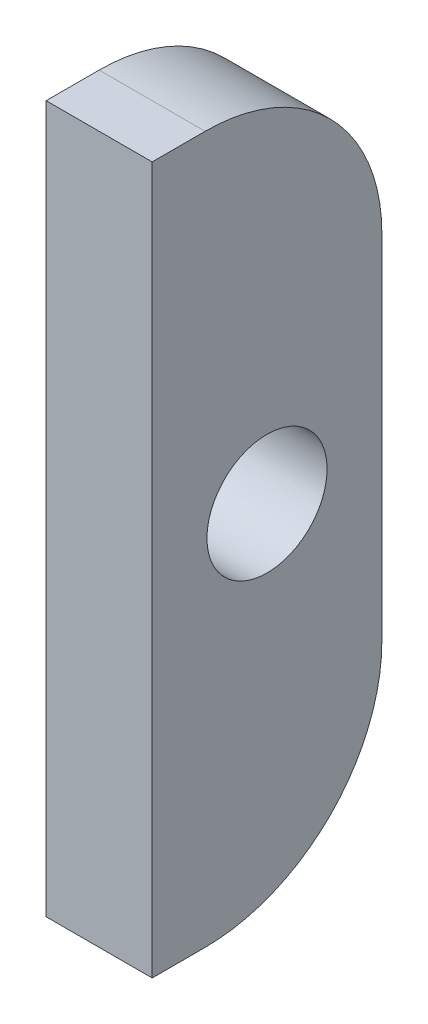
ISO-10303-21;
HEADER;
FILE_DESCRIPTION(('STEP AP214'),'2;1');
FILE_NAME('part.step','',(''),(''),'','','');
FILE_SCHEMA(('AUTOMOTIVE_DESIGN { 1 0 10303 214 1 1 1 1 }'));
ENDSEC;
DATA;
#1=APPLICATION_CONTEXT('core data for automotive mechanical design processes');
#2=APPLICATION_PROTOCOL_DEFINITION('international standard','automotive_design',2000,#1);
#3=PRODUCT_CONTEXT('',#1,'mechanical');
#4=PRODUCT('Part','Part','',(#3));
#5=PRODUCT_RELATED_PRODUCT_CATEGORY('part','',(#4));
#6=PRODUCT_DEFINITION_FORMATION('','',#4);
#7=PRODUCT_DEFINITION_CONTEXT('part definition',#1,'design');
#8=PRODUCT_DEFINITION('design','',#6,#7);
#9=PRODUCT_DEFINITION_SHAPE('','',#8);
#10=(LENGTH_UNIT() NAMED_UNIT(*) SI_UNIT(.MILLI.,.METRE.));
#11=(NAMED_UNIT(*) PLANE_ANGLE_UNIT() SI_UNIT($,.RADIAN.));
#12=(NAMED_UNIT(*) SI_UNIT($,.STERADIAN.) SOLID_ANGLE_UNIT());
#13=UNCERTAINTY_MEASURE_WITH_UNIT(LENGTH_MEASURE(1.E-05),#10,'distance_accuracy_value','');
#14=(GEOMETRIC_REPRESENTATION_CONTEXT(3) GLOBAL_UNCERTAINTY_ASSIGNED_CONTEXT((#13)) GLOBAL_UNIT_ASSIGNED_CONTEXT((#10,
#11,#12)) REPRESENTATION_CONTEXT('',''));
#15=CARTESIAN_POINT('',(0.,0.,0.));
#16=DIRECTION('',(0.,0.,1.));
#17=DIRECTION('',(1.,0.,0.));
#18=AXIS2_PLACEMENT_3D('',#15,#16,#17);
#19=CARTESIAN_POINT('',(-601.499999999998,-70.0000000000007,216.999999999999));
#20=DIRECTION('',(0.,-1.00000000000001,0.));
#21=DIRECTION('',(0.,0.,-0.999999999999999));
#22=AXIS2_PLACEMENT_3D('',#19,#20,#21);
#23=PLANE('',#22);
#24=DIRECTION('',(0.,0.,0.999999999999999));
#25=VECTOR('',#24,1.);
#26=CARTESIAN_POINT('',(-607.499999999998,-70.0000000000005,217.));
#27=LINE('',#26,#25);
#28=CARTESIAN_POINT('',(-607.499999999998,-70.0000000000001,227.));
#29=VERTEX_POINT('',#28);
#30=CARTESIAN_POINT('',(-607.5,-70.0000000000043,230.));
#31=VERTEX_POINT('',#30);
#32=EDGE_CURVE('E115',#29,#31,#27,.T.);
#33=ORIENTED_EDGE('',*,*,#32,.F.);
#34=DIRECTION('',(-1.,0.,0.));
#35=VECTOR('',#34,1.);
#36=CARTESIAN_POINT('',(-601.499999999998,-69.9999999999998,226.999999999999));
#37=LINE('',#36,#35);
#38=CARTESIAN_POINT('',(-601.499999999998,-69.9999999999998,226.999999999999));
#39=VERTEX_POINT('',#38);
#40=EDGE_CURVE('E59',#29,#39,#37,.F.);
#41=ORIENTED_EDGE('',*,*,#40,.T.);
#42=DIRECTION('',(0.,0.,0.999999999999999));
#43=VECTOR('',#42,1.);
#44=CARTESIAN_POINT('',(-601.499999999998,-70.0000000000007,216.999999999999));
#45=LINE('',#44,#43);
#46=CARTESIAN_POINT('',(-601.500000000001,-70.0000000000038,229.999999999999));
#47=VERTEX_POINT('',#46);
#48=EDGE_CURVE('E90',#39,#47,#45,.T.);
#49=ORIENTED_EDGE('',*,*,#48,.T.);
#50=DIRECTION('',(-1.,0.,0.));
#51=VECTOR('',#50,1.);
#52=CARTESIAN_POINT('',(-601.500000000001,-70.0000000000038,229.999999999999));
#53=LINE('',#52,#51);
#54=EDGE_CURVE('E92',#47,#31,#53,.T.);
#55=ORIENTED_EDGE('',*,*,#54,.T.);
#56=EDGE_LOOP('',(#33,#41,#49,#55));
#57=FACE_BOUND('',#56,.T.);
#58=ADVANCED_FACE('F36',(#57),#23,.T.);
#59=CARTESIAN_POINT('',(-601.499999999998,-30.0000000000002,216.999999999999));
#60=DIRECTION('',(0.,0.,-0.999999999999999));
#61=DIRECTION('',(-1.,0.,0.));
#62=AXIS2_PLACEMENT_3D('',#59,#60,#61);
#63=PLANE('',#62);
#64=DIRECTION('',(0.,-1.00000000000001,0.));
#65=VECTOR('',#64,1.);
#66=CARTESIAN_POINT('',(-601.499999999998,-30.0000000000002,216.999999999999));
#67=LINE('',#66,#65);
#68=CARTESIAN_POINT('',(-601.499999999998,-40.0000000000007,216.999999999999));
#69=VERTEX_POINT('',#68);
#70=CARTESIAN_POINT('',(-601.499999999998,-60.0000000000003,217.));
#71=VERTEX_POINT('',#70);
#72=EDGE_CURVE('E105',#69,#71,#67,.T.);
#73=ORIENTED_EDGE('',*,*,#72,.T.);
#74=DIRECTION('',(-1.,0.,0.));
#75=VECTOR('',#74,1.);
#76=CARTESIAN_POINT('',(-601.499999999998,-60.0000000000003,217.));
#77=LINE('',#76,#75);
#78=CARTESIAN_POINT('',(-607.499999999998,-60.0000000000007,217.));
#79=VERTEX_POINT('',#78);
#80=EDGE_CURVE('E127',#71,#79,#77,.T.);
#81=ORIENTED_EDGE('',*,*,#80,.T.);
#82=DIRECTION('',(0.,-1.00000000000001,0.));
#83=VECTOR('',#82,1.);
#84=CARTESIAN_POINT('',(-607.499999999998,-29.9999999999998,216.999999999999));
#85=LINE('',#84,#83);
#86=CARTESIAN_POINT('',(-607.499999999998,-40.,217.));
#87=VERTEX_POINT('',#86);
#88=EDGE_CURVE('E97',#87,#79,#85,.T.);
#89=ORIENTED_EDGE('',*,*,#88,.F.);
#90=DIRECTION('',(-1.,0.,0.));
#91=VECTOR('',#90,1.);
#92=CARTESIAN_POINT('',(-601.499999999998,-40.0000000000007,216.999999999999));
#93=LINE('',#92,#91);
#94=EDGE_CURVE('E124',#87,#69,#93,.F.);
#95=ORIENTED_EDGE('',*,*,#94,.T.);
#96=EDGE_LOOP('',(#73,#81,#89,#95));
#97=FACE_BOUND('',#96,.T.);
#98=ADVANCED_FACE('F138',(#97),#63,.T.);
#99=CARTESIAN_POINT('',(-601.5,-30.000000000004,229.999999999999));
#100=DIRECTION('',(0.,1.00000000000001,0.));
#101=DIRECTION('',(0.,0.,0.999999999999999));
#102=AXIS2_PLACEMENT_3D('',#99,#100,#101);
#103=PLANE('',#102);
#104=DIRECTION('',(0.,0.,-0.999999999999999));
#105=VECTOR('',#104,1.);
#106=CARTESIAN_POINT('',(-601.5,-30.000000000004,229.999999999999));
#107=LINE('',#106,#105);
#108=CARTESIAN_POINT('',(-601.5,-30.000000000004,229.999999999999));
#109=VERTEX_POINT('',#108);
#110=CARTESIAN_POINT('',(-601.5,-30.,226.999999999999));
#111=VERTEX_POINT('',#110);
#112=EDGE_CURVE('E108',#109,#111,#107,.T.);
#113=ORIENTED_EDGE('',*,*,#112,.T.);
#114=DIRECTION('',(-1.,0.,0.));
#115=VECTOR('',#114,1.);
#116=CARTESIAN_POINT('',(-601.5,-30.,226.999999999999));
#117=LINE('',#116,#115);
#118=CARTESIAN_POINT('',(-607.5,-30.,226.999999999999));
#119=VERTEX_POINT('',#118);
#120=EDGE_CURVE('E11',#111,#119,#117,.T.);
#121=ORIENTED_EDGE('',*,*,#120,.T.);
#122=DIRECTION('',(0.,0.,-0.999999999999999));
#123=VECTOR('',#122,1.);
#124=CARTESIAN_POINT('',(-607.5,-30.000000000004,229.999999999999));
#125=LINE('',#124,#123);
#126=CARTESIAN_POINT('',(-607.5,-30.000000000004,229.999999999999));
#127=VERTEX_POINT('',#126);
#128=EDGE_CURVE('E119',#127,#119,#125,.T.);
#129=ORIENTED_EDGE('',*,*,#128,.F.);
#130=DIRECTION('',(-1.,0.,0.));
#131=VECTOR('',#130,1.);
#132=CARTESIAN_POINT('',(-601.5,-30.000000000004,229.999999999999));
#133=LINE('',#132,#131);
#134=EDGE_CURVE('E104',#109,#127,#133,.T.);
#135=ORIENTED_EDGE('',*,*,#134,.F.);
#136=EDGE_LOOP('',(#113,#121,#129,#135));
#137=FACE_BOUND('',#136,.T.);
#138=ADVANCED_FACE('F148',(#137),#103,.T.);
#139=CARTESIAN_POINT('',(-601.500000000001,-70.0000000000038,229.999999999999));
#140=DIRECTION('',(0.,0.,0.999999999999999));
#141=DIRECTION('',(1.,0.,0.));
#142=AXIS2_PLACEMENT_3D('',#139,#140,#141);
#143=PLANE('',#142);
#144=DIRECTION('',(0.,1.00000000000001,0.));
#145=VECTOR('',#144,1.);
#146=CARTESIAN_POINT('',(-607.5,-70.0000000000043,230.));
#147=LINE('',#146,#145);
#148=EDGE_CURVE('E103',#31,#127,#147,.T.);
#149=ORIENTED_EDGE('',*,*,#148,.F.);
#150=ORIENTED_EDGE('',*,*,#54,.F.);
#151=DIRECTION('',(0.,1.00000000000001,0.));
#152=VECTOR('',#151,1.);
#153=CARTESIAN_POINT('',(-601.500000000001,-70.0000000000038,229.999999999999));
#154=LINE('',#153,#152);
#155=EDGE_CURVE('E96',#47,#109,#154,.T.);
#156=ORIENTED_EDGE('',*,*,#155,.T.);
#157=ORIENTED_EDGE('',*,*,#134,.T.);
#158=EDGE_LOOP('',(#149,#150,#156,#157));
#159=FACE_BOUND('',#158,.T.);
#160=ADVANCED_FACE('F101',(#159),#143,.T.);
#161=CARTESIAN_POINT('',(-601.5,0.,0.));
#162=DIRECTION('',(-1.,0.,0.));
#163=DIRECTION('',(0.,0.,0.999999999999999));
#164=AXIS2_PLACEMENT_3D('',#161,#162,#163);
#165=PLANE('',#164);
#166=CARTESIAN_POINT('',(-601.499999999998,-50.0000000000005,223.499999999999));
#167=DIRECTION('',(-1.,0.,0.));
#168=DIRECTION('',(0.,0.,0.999999999999999));
#169=AXIS2_PLACEMENT_3D('',#166,#167,#168);
#170=CIRCLE('',#169,3.4);
#171=CARTESIAN_POINT('',(-601.499999999998,-50.0000000000005,226.899999999999));
#172=VERTEX_POINT('',#171);
#173=EDGE_CURVE('E117',#172,#172,#170,.T.);
#174=ORIENTED_EDGE('',*,*,#173,.T.);
#175=EDGE_LOOP('',(#174));
#176=FACE_BOUND('',#175,.T.);
#177=ORIENTED_EDGE('',*,*,#48,.F.);
#178=CARTESIAN_POINT('',(-601.499999999998,-59.9999999999998,227.));
#179=DIRECTION('',(-1.,0.,0.));
#180=DIRECTION('',(0.,0.,0.999999999999999));
#181=AXIS2_PLACEMENT_3D('',#178,#179,#180);
#182=CIRCLE('',#181,10.);
#183=EDGE_CURVE('E44',#39,#71,#182,.F.);
#184=ORIENTED_EDGE('',*,*,#183,.T.);
#185=ORIENTED_EDGE('',*,*,#72,.F.);
#186=CARTESIAN_POINT('',(-601.5,-39.9999999999998,226.999999999999));
#187=DIRECTION('',(-1.,0.,0.));
#188=DIRECTION('',(0.,0.,0.999999999999999));
#189=AXIS2_PLACEMENT_3D('',#186,#187,#188);
#190=CIRCLE('',#189,10.);
#191=EDGE_CURVE('E51',#69,#111,#190,.F.);
#192=ORIENTED_EDGE('',*,*,#191,.T.);
#193=ORIENTED_EDGE('',*,*,#112,.F.);
#194=ORIENTED_EDGE('',*,*,#155,.F.);
#195=EDGE_LOOP('',(#177,#184,#185,#192,#193,#194));
#196=FACE_BOUND('',#195,.T.);
#197=ADVANCED_FACE('F107',(#176,#196),#165,.F.);
#198=CARTESIAN_POINT('',(-607.5,0.,0.));
#199=DIRECTION('',(-1.,0.,0.));
#200=DIRECTION('',(0.,0.,0.999999999999999));
#201=AXIS2_PLACEMENT_3D('',#198,#199,#200);
#202=PLANE('',#201);
#203=CARTESIAN_POINT('',(-607.499999999998,-50.0000000000003,223.5));
#204=DIRECTION('',(-1.,0.,0.));
#205=DIRECTION('',(0.,0.,0.999999999999999));
#206=AXIS2_PLACEMENT_3D('',#203,#204,#205);
#207=CIRCLE('',#206,3.4);
#208=CARTESIAN_POINT('',(-607.499999999998,-50.0000000000003,226.9));
#209=VERTEX_POINT('',#208);
#210=EDGE_CURVE('E184',#209,#209,#207,.T.);
#211=ORIENTED_EDGE('',*,*,#210,.F.);
#212=EDGE_LOOP('',(#211));
#213=FACE_BOUND('',#212,.T.);
#214=ORIENTED_EDGE('',*,*,#88,.T.);
#215=CARTESIAN_POINT('',(-607.499999999999,-59.9999999999998,227.));
#216=DIRECTION('',(-1.,0.,0.));
#217=DIRECTION('',(0.,0.,0.999999999999999));
#218=AXIS2_PLACEMENT_3D('',#215,#216,#217);
#219=CIRCLE('',#218,10.);
#220=EDGE_CURVE('E132',#79,#29,#219,.T.);
#221=ORIENTED_EDGE('',*,*,#220,.T.);
#222=ORIENTED_EDGE('',*,*,#32,.T.);
#223=ORIENTED_EDGE('',*,*,#148,.T.);
#224=ORIENTED_EDGE('',*,*,#128,.T.);
#225=CARTESIAN_POINT('',(-607.5,-39.9999999999994,227.));
#226=DIRECTION('',(-1.,0.,0.));
#227=DIRECTION('',(0.,0.,0.999999999999999));
#228=AXIS2_PLACEMENT_3D('',#225,#226,#227);
#229=CIRCLE('',#228,10.);
#230=EDGE_CURVE('E130',#119,#87,#229,.T.);
#231=ORIENTED_EDGE('',*,*,#230,.T.);
#232=EDGE_LOOP('',(#214,#221,#222,#223,#224,#231));
#233=FACE_BOUND('',#232,.T.);
#234=ADVANCED_FACE('F143',(#213,#233),#202,.T.);
#235=CARTESIAN_POINT('',(-601.499999999998,-59.9999999999998,227.));
#236=DIRECTION('',(-1.,0.,0.));
#237=DIRECTION('',(0.,0.,0.999999999999999));
#238=AXIS2_PLACEMENT_3D('',#235,#236,#237);
#239=CYLINDRICAL_SURFACE('',#238,10.);
#240=ORIENTED_EDGE('',*,*,#183,.F.);
#241=ORIENTED_EDGE('',*,*,#40,.F.);
#242=ORIENTED_EDGE('',*,*,#220,.F.);
#243=ORIENTED_EDGE('',*,*,#80,.F.);
#244=EDGE_LOOP('',(#240,#241,#242,#243));
#245=FACE_BOUND('',#244,.T.);
#246=ADVANCED_FACE('F141',(#245),#239,.T.);
#247=CARTESIAN_POINT('',(-601.5,-39.9999999999998,226.999999999999));
#248=DIRECTION('',(-1.,0.,0.));
#249=DIRECTION('',(0.,0.,0.999999999999999));
#250=AXIS2_PLACEMENT_3D('',#247,#248,#249);
#251=CYLINDRICAL_SURFACE('',#250,10.);
#252=ORIENTED_EDGE('',*,*,#191,.F.);
#253=ORIENTED_EDGE('',*,*,#94,.F.);
#254=ORIENTED_EDGE('',*,*,#230,.F.);
#255=ORIENTED_EDGE('',*,*,#120,.F.);
#256=EDGE_LOOP('',(#252,#253,#254,#255));
#257=FACE_BOUND('',#256,.T.);
#258=ADVANCED_FACE('F38',(#257),#251,.T.);
#259=CARTESIAN_POINT('',(-607.499999999998,-50.0000000000003,223.5));
#260=DIRECTION('',(-1.,0.,0.));
#261=DIRECTION('',(0.,0.,0.999999999999999));
#262=AXIS2_PLACEMENT_3D('',#259,#260,#261);
#263=CYLINDRICAL_SURFACE('',#262,3.4);
#264=ORIENTED_EDGE('',*,*,#173,.F.);
#265=EDGE_LOOP('',(#264));
#266=FACE_BOUND('',#265,.T.);
#267=ORIENTED_EDGE('',*,*,#210,.T.);
#268=EDGE_LOOP('',(#267));
#269=FACE_BOUND('',#268,.T.);
#270=ADVANCED_FACE('F166',(#266,#269),#263,.F.);
#271=CLOSED_SHELL('',(#58,#98,#138,#160,#197,#234,#246,#258,#270));
#272=MANIFOLD_SOLID_BREP('B2',#271);
#273=ADVANCED_BREP_SHAPE_REPRESENTATION('',(#18,#272),#14);
#274=SHAPE_DEFINITION_REPRESENTATION(#9,#273);
ENDSEC;
END-ISO-10303-21;
